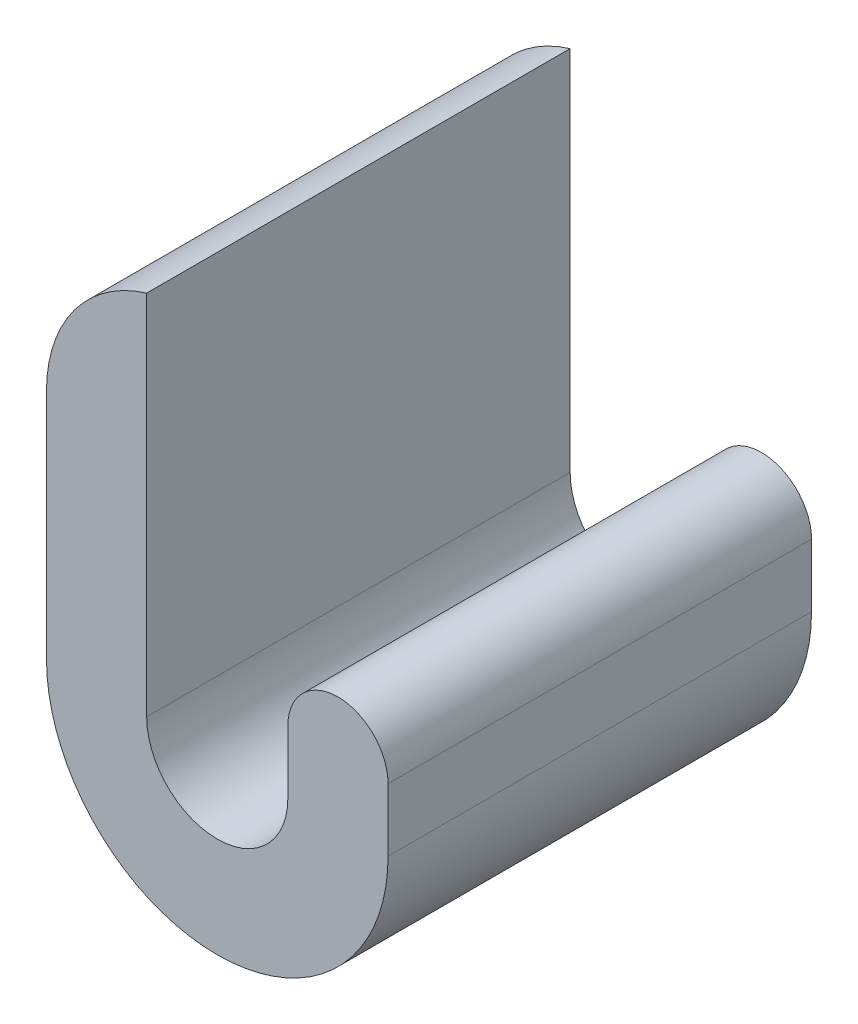
ISO-10303-21;
HEADER;
FILE_DESCRIPTION(('STEP AP214'),'2;1');
FILE_NAME('part.step','',(''),(''),'','','');
FILE_SCHEMA(('AUTOMOTIVE_DESIGN { 1 0 10303 214 1 1 1 1 }'));
ENDSEC;
DATA;
#1=APPLICATION_CONTEXT('core data for automotive mechanical design processes');
#2=APPLICATION_PROTOCOL_DEFINITION('international standard','automotive_design',2000,#1);
#3=PRODUCT_CONTEXT('',#1,'mechanical');
#4=PRODUCT('Part','Part','',(#3));
#5=PRODUCT_RELATED_PRODUCT_CATEGORY('part','',(#4));
#6=PRODUCT_DEFINITION_FORMATION('','',#4);
#7=PRODUCT_DEFINITION_CONTEXT('part definition',#1,'design');
#8=PRODUCT_DEFINITION('design','',#6,#7);
#9=PRODUCT_DEFINITION_SHAPE('','',#8);
#10=(LENGTH_UNIT() NAMED_UNIT(*) SI_UNIT(.MILLI.,.METRE.));
#11=(NAMED_UNIT(*) PLANE_ANGLE_UNIT() SI_UNIT($,.RADIAN.));
#12=(NAMED_UNIT(*) SI_UNIT($,.STERADIAN.) SOLID_ANGLE_UNIT());
#13=UNCERTAINTY_MEASURE_WITH_UNIT(LENGTH_MEASURE(1.E-05),#10,'distance_accuracy_value','');
#14=(GEOMETRIC_REPRESENTATION_CONTEXT(3) GLOBAL_UNCERTAINTY_ASSIGNED_CONTEXT((#13)) GLOBAL_UNIT_ASSIGNED_CONTEXT((#10,
#11,#12)) REPRESENTATION_CONTEXT('',''));
#15=CARTESIAN_POINT('',(0.,0.,0.));
#16=DIRECTION('',(0.,0.,1.));
#17=DIRECTION('',(1.,0.,0.));
#18=AXIS2_PLACEMENT_3D('',#15,#16,#17);
#19=CARTESIAN_POINT('',(8.55,4.45,0.));
#20=DIRECTION('',(0.,0.,1.));
#21=DIRECTION('',(1.,0.,0.));
#22=AXIS2_PLACEMENT_3D('',#19,#20,#21);
#23=CYLINDRICAL_SURFACE('',#22,3.55);
#24=DIRECTION('',(0.,0.,1.));
#25=VECTOR('',#24,1.);
#26=CARTESIAN_POINT('',(5.,4.45,-30.));
#27=LINE('',#26,#25);
#28=CARTESIAN_POINT('',(5.,4.45,0.));
#29=VERTEX_POINT('',#28);
#30=CARTESIAN_POINT('',(5.,4.45,-30.));
#31=VERTEX_POINT('',#30);
#32=EDGE_CURVE('E157',#29,#31,#27,.F.);
#33=ORIENTED_EDGE('',*,*,#32,.F.);
#34=CARTESIAN_POINT('',(8.55,4.45,0.));
#35=DIRECTION('',(0.,0.,1.));
#36=DIRECTION('',(1.,0.,0.));
#37=AXIS2_PLACEMENT_3D('',#34,#35,#36);
#38=CIRCLE('',#37,3.55);
#39=CARTESIAN_POINT('',(12.1,4.45,0.));
#40=VERTEX_POINT('',#39);
#41=EDGE_CURVE('E40',#40,#29,#38,.T.);
#42=ORIENTED_EDGE('',*,*,#41,.F.);
#43=DIRECTION('',(0.,0.,1.));
#44=VECTOR('',#43,1.);
#45=CARTESIAN_POINT('',(12.1,4.45,-30.));
#46=LINE('',#45,#44);
#47=CARTESIAN_POINT('',(12.1,4.45,-30.));
#48=VERTEX_POINT('',#47);
#49=EDGE_CURVE('E160',#48,#40,#46,.T.);
#50=ORIENTED_EDGE('',*,*,#49,.F.);
#51=CARTESIAN_POINT('',(8.55,4.45,-30.));
#52=DIRECTION('',(0.,0.,1.));
#53=DIRECTION('',(1.,0.,0.));
#54=AXIS2_PLACEMENT_3D('',#51,#52,#53);
#55=CIRCLE('',#54,3.55);
#56=EDGE_CURVE('E11',#31,#48,#55,.F.);
#57=ORIENTED_EDGE('',*,*,#56,.F.);
#58=EDGE_LOOP('',(#33,#42,#50,#57));
#59=FACE_BOUND('',#58,.T.);
#60=ADVANCED_FACE('F33',(#59),#23,.T.);
#61=CARTESIAN_POINT('',(0.,0.,-30.));
#62=DIRECTION('',(0.,0.,1.));
#63=DIRECTION('',(1.,0.,0.));
#64=AXIS2_PLACEMENT_3D('',#61,#62,#63);
#65=CYLINDRICAL_SURFACE('',#64,5.);
#66=CARTESIAN_POINT('',(0.,0.,0.));
#67=DIRECTION('',(0.,0.,-1.));
#68=DIRECTION('',(1.,0.,0.));
#69=AXIS2_PLACEMENT_3D('',#66,#67,#68);
#70=CIRCLE('',#69,5.);
#71=CARTESIAN_POINT('',(5.,0.,0.));
#72=VERTEX_POINT('',#71);
#73=CARTESIAN_POINT('',(-5.,0.,0.));
#74=VERTEX_POINT('',#73);
#75=EDGE_CURVE('E135',#72,#74,#70,.T.);
#76=ORIENTED_EDGE('',*,*,#75,.F.);
#77=DIRECTION('',(0.,0.,1.));
#78=VECTOR('',#77,1.);
#79=CARTESIAN_POINT('',(5.,0.,-30.));
#80=LINE('',#79,#78);
#81=CARTESIAN_POINT('',(5.,0.,-30.));
#82=VERTEX_POINT('',#81);
#83=EDGE_CURVE('E121',#82,#72,#80,.T.);
#84=ORIENTED_EDGE('',*,*,#83,.F.);
#85=CARTESIAN_POINT('',(0.,0.,-30.));
#86=DIRECTION('',(0.,0.,-1.));
#87=DIRECTION('',(1.,0.,0.));
#88=AXIS2_PLACEMENT_3D('',#85,#86,#87);
#89=CIRCLE('',#88,5.);
#90=CARTESIAN_POINT('',(-5.,0.,-30.));
#91=VERTEX_POINT('',#90);
#92=EDGE_CURVE('E112',#82,#91,#89,.T.);
#93=ORIENTED_EDGE('',*,*,#92,.T.);
#94=DIRECTION('',(0.,0.,1.));
#95=VECTOR('',#94,1.);
#96=CARTESIAN_POINT('',(-5.,0.,-30.));
#97=LINE('',#96,#95);
#98=EDGE_CURVE('E95',#91,#74,#97,.T.);
#99=ORIENTED_EDGE('',*,*,#98,.T.);
#100=EDGE_LOOP('',(#76,#84,#93,#99));
#101=FACE_BOUND('',#100,.T.);
#102=ADVANCED_FACE('F119',(#101),#65,.F.);
#103=CARTESIAN_POINT('',(5.,0.,-30.));
#104=DIRECTION('',(-1.,0.,0.));
#105=DIRECTION('',(0.,0.,1.));
#106=AXIS2_PLACEMENT_3D('',#103,#104,#105);
#107=PLANE('',#106);
#108=DIRECTION('',(0.,-1.,0.));
#109=VECTOR('',#108,1.);
#110=CARTESIAN_POINT('',(5.,0.,0.));
#111=LINE('',#110,#109);
#112=EDGE_CURVE('E122',#29,#72,#111,.T.);
#113=ORIENTED_EDGE('',*,*,#112,.F.);
#114=ORIENTED_EDGE('',*,*,#32,.T.);
#115=DIRECTION('',(0.,-1.,0.));
#116=VECTOR('',#115,1.);
#117=CARTESIAN_POINT('',(5.,0.,-30.));
#118=LINE('',#117,#116);
#119=EDGE_CURVE('E108',#31,#82,#118,.T.);
#120=ORIENTED_EDGE('',*,*,#119,.T.);
#121=ORIENTED_EDGE('',*,*,#83,.T.);
#122=EDGE_LOOP('',(#113,#114,#120,#121));
#123=FACE_BOUND('',#122,.T.);
#124=ADVANCED_FACE('F166',(#123),#107,.T.);
#125=CARTESIAN_POINT('',(12.1,8.,-30.));
#126=DIRECTION('',(1.,0.,0.));
#127=DIRECTION('',(0.,0.,-1.));
#128=AXIS2_PLACEMENT_3D('',#125,#126,#127);
#129=PLANE('',#128);
#130=DIRECTION('',(0.,1.,0.));
#131=VECTOR('',#130,1.);
#132=CARTESIAN_POINT('',(12.1,8.,-30.));
#133=LINE('',#132,#131);
#134=CARTESIAN_POINT('',(12.1,0.,-30.));
#135=VERTEX_POINT('',#134);
#136=EDGE_CURVE('E131',#135,#48,#133,.T.);
#137=ORIENTED_EDGE('',*,*,#136,.T.);
#138=ORIENTED_EDGE('',*,*,#49,.T.);
#139=DIRECTION('',(0.,1.,0.));
#140=VECTOR('',#139,1.);
#141=CARTESIAN_POINT('',(12.1,8.,0.));
#142=LINE('',#141,#140);
#143=CARTESIAN_POINT('',(12.1,0.,0.));
#144=VERTEX_POINT('',#143);
#145=EDGE_CURVE('E124',#144,#40,#142,.T.);
#146=ORIENTED_EDGE('',*,*,#145,.F.);
#147=DIRECTION('',(0.,0.,1.));
#148=VECTOR('',#147,1.);
#149=CARTESIAN_POINT('',(12.1,0.,-30.));
#150=LINE('',#149,#148);
#151=EDGE_CURVE('E147',#135,#144,#150,.T.);
#152=ORIENTED_EDGE('',*,*,#151,.F.);
#153=EDGE_LOOP('',(#137,#138,#146,#152));
#154=FACE_BOUND('',#153,.T.);
#155=ADVANCED_FACE('F188',(#154),#129,.T.);
#156=CARTESIAN_POINT('',(0.,0.,-30.));
#157=DIRECTION('',(0.,0.,1.));
#158=DIRECTION('',(1.,0.,0.));
#159=AXIS2_PLACEMENT_3D('',#156,#157,#158);
#160=CYLINDRICAL_SURFACE('',#159,12.1);
#161=CARTESIAN_POINT('',(0.,0.,0.));
#162=DIRECTION('',(0.,0.,1.));
#163=DIRECTION('',(1.,0.,0.));
#164=AXIS2_PLACEMENT_3D('',#161,#162,#163);
#165=CIRCLE('',#164,12.1);
#166=CARTESIAN_POINT('',(-12.1,0.,0.));
#167=VERTEX_POINT('',#166);
#168=EDGE_CURVE('E140',#167,#144,#165,.T.);
#169=ORIENTED_EDGE('',*,*,#168,.F.);
#170=DIRECTION('',(0.,0.,1.));
#171=VECTOR('',#170,1.);
#172=CARTESIAN_POINT('',(-12.1,0.,-30.));
#173=LINE('',#172,#171);
#174=CARTESIAN_POINT('',(-12.1,0.,-30.));
#175=VERTEX_POINT('',#174);
#176=EDGE_CURVE('E149',#175,#167,#173,.T.);
#177=ORIENTED_EDGE('',*,*,#176,.F.);
#178=CARTESIAN_POINT('',(0.,0.,-30.));
#179=DIRECTION('',(0.,0.,1.));
#180=DIRECTION('',(1.,0.,0.));
#181=AXIS2_PLACEMENT_3D('',#178,#179,#180);
#182=CIRCLE('',#181,12.1);
#183=EDGE_CURVE('E128',#175,#135,#182,.T.);
#184=ORIENTED_EDGE('',*,*,#183,.T.);
#185=ORIENTED_EDGE('',*,*,#151,.T.);
#186=EDGE_LOOP('',(#169,#177,#184,#185));
#187=FACE_BOUND('',#186,.T.);
#188=ADVANCED_FACE('F195',(#187),#160,.T.);
#189=CARTESIAN_POINT('',(-12.1,26.,-30.));
#190=DIRECTION('',(-1.,0.,0.));
#191=DIRECTION('',(0.,-1.,0.));
#192=AXIS2_PLACEMENT_3D('',#189,#190,#191);
#193=PLANE('',#192);
#194=DIRECTION('',(0.,-1.,0.));
#195=VECTOR('',#194,1.);
#196=CARTESIAN_POINT('',(-12.1,26.,0.));
#197=LINE('',#196,#195);
#198=CARTESIAN_POINT('',(-12.1,16.4297335460291,0.));
#199=VERTEX_POINT('',#198);
#200=EDGE_CURVE('E138',#199,#167,#197,.T.);
#201=ORIENTED_EDGE('',*,*,#200,.F.);
#202=DIRECTION('',(0.,0.,1.));
#203=VECTOR('',#202,1.);
#204=CARTESIAN_POINT('',(-12.1,16.4297335460291,-30.));
#205=LINE('',#204,#203);
#206=CARTESIAN_POINT('',(-12.1,16.4297335460291,-30.));
#207=VERTEX_POINT('',#206);
#208=EDGE_CURVE('E154',#199,#207,#205,.F.);
#209=ORIENTED_EDGE('',*,*,#208,.T.);
#210=DIRECTION('',(0.,-1.,0.));
#211=VECTOR('',#210,1.);
#212=CARTESIAN_POINT('',(-12.1,26.,-30.));
#213=LINE('',#212,#211);
#214=EDGE_CURVE('E116',#207,#175,#213,.T.);
#215=ORIENTED_EDGE('',*,*,#214,.T.);
#216=ORIENTED_EDGE('',*,*,#176,.T.);
#217=EDGE_LOOP('',(#201,#209,#215,#216));
#218=FACE_BOUND('',#217,.T.);
#219=ADVANCED_FACE('F171',(#218),#193,.T.);
#220=CARTESIAN_POINT('',(-5.,0.,-30.));
#221=DIRECTION('',(1.,0.,0.));
#222=DIRECTION('',(0.,0.,-1.));
#223=AXIS2_PLACEMENT_3D('',#220,#221,#222);
#224=PLANE('',#223);
#225=DIRECTION('',(0.,1.,0.));
#226=VECTOR('',#225,1.);
#227=CARTESIAN_POINT('',(-5.,0.,0.));
#228=LINE('',#227,#226);
#229=CARTESIAN_POINT('',(-5.,26.,0.));
#230=VERTEX_POINT('',#229);
#231=EDGE_CURVE('E102',#74,#230,#228,.T.);
#232=ORIENTED_EDGE('',*,*,#231,.F.);
#233=ORIENTED_EDGE('',*,*,#98,.F.);
#234=DIRECTION('',(0.,1.,0.));
#235=VECTOR('',#234,1.);
#236=CARTESIAN_POINT('',(-5.,0.,-30.));
#237=LINE('',#236,#235);
#238=CARTESIAN_POINT('',(-5.,26.,-30.));
#239=VERTEX_POINT('',#238);
#240=EDGE_CURVE('E99',#91,#239,#237,.T.);
#241=ORIENTED_EDGE('',*,*,#240,.T.);
#242=DIRECTION('',(0.,0.,1.));
#243=VECTOR('',#242,1.);
#244=CARTESIAN_POINT('',(-5.,26.,-30.));
#245=LINE('',#244,#243);
#246=EDGE_CURVE('E107',#239,#230,#245,.T.);
#247=ORIENTED_EDGE('',*,*,#246,.T.);
#248=EDGE_LOOP('',(#232,#233,#241,#247));
#249=FACE_BOUND('',#248,.T.);
#250=ADVANCED_FACE('F97',(#249),#224,.T.);
#251=CARTESIAN_POINT('',(0.,0.,-30.));
#252=DIRECTION('',(0.,0.,1.));
#253=DIRECTION('',(1.,0.,0.));
#254=AXIS2_PLACEMENT_3D('',#251,#252,#253);
#255=PLANE('',#254);
#256=ORIENTED_EDGE('',*,*,#119,.F.);
#257=ORIENTED_EDGE('',*,*,#56,.T.);
#258=ORIENTED_EDGE('',*,*,#136,.F.);
#259=ORIENTED_EDGE('',*,*,#183,.F.);
#260=ORIENTED_EDGE('',*,*,#214,.F.);
#261=CARTESIAN_POINT('',(-2.1,16.4297335460291,-30.));
#262=DIRECTION('',(0.,0.,1.));
#263=DIRECTION('',(1.,0.,0.));
#264=AXIS2_PLACEMENT_3D('',#261,#262,#263);
#265=CIRCLE('',#264,10.);
#266=EDGE_CURVE('E115',#207,#239,#265,.F.);
#267=ORIENTED_EDGE('',*,*,#266,.T.);
#268=ORIENTED_EDGE('',*,*,#240,.F.);
#269=ORIENTED_EDGE('',*,*,#92,.F.);
#270=EDGE_LOOP('',(#256,#257,#258,#259,#260,#267,#268,#269));
#271=FACE_BOUND('',#270,.T.);
#272=ADVANCED_FACE('F111',(#271),#255,.F.);
#273=CARTESIAN_POINT('',(0.,0.,0.));
#274=DIRECTION('',(0.,0.,1.));
#275=DIRECTION('',(1.,0.,0.));
#276=AXIS2_PLACEMENT_3D('',#273,#274,#275);
#277=PLANE('',#276);
#278=ORIENTED_EDGE('',*,*,#145,.T.);
#279=ORIENTED_EDGE('',*,*,#41,.T.);
#280=ORIENTED_EDGE('',*,*,#112,.T.);
#281=ORIENTED_EDGE('',*,*,#75,.T.);
#282=ORIENTED_EDGE('',*,*,#231,.T.);
#283=CARTESIAN_POINT('',(-2.1,16.4297335460291,0.));
#284=DIRECTION('',(0.,0.,1.));
#285=DIRECTION('',(1.,0.,0.));
#286=AXIS2_PLACEMENT_3D('',#283,#284,#285);
#287=CIRCLE('',#286,10.);
#288=EDGE_CURVE('E146',#230,#199,#287,.T.);
#289=ORIENTED_EDGE('',*,*,#288,.T.);
#290=ORIENTED_EDGE('',*,*,#200,.T.);
#291=ORIENTED_EDGE('',*,*,#168,.T.);
#292=EDGE_LOOP('',(#278,#279,#280,#281,#282,#289,#290,#291));
#293=FACE_BOUND('',#292,.T.);
#294=ADVANCED_FACE('F162',(#293),#277,.T.);
#295=CARTESIAN_POINT('',(-2.1,16.4297335460291,-30.));
#296=DIRECTION('',(0.,0.,-1.));
#297=DIRECTION('',(-1.,0.,0.));
#298=AXIS2_PLACEMENT_3D('',#295,#296,#297);
#299=CYLINDRICAL_SURFACE('',#298,10.);
#300=ORIENTED_EDGE('',*,*,#266,.F.);
#301=ORIENTED_EDGE('',*,*,#208,.F.);
#302=ORIENTED_EDGE('',*,*,#288,.F.);
#303=ORIENTED_EDGE('',*,*,#246,.F.);
#304=EDGE_LOOP('',(#300,#301,#302,#303));
#305=FACE_BOUND('',#304,.T.);
#306=ADVANCED_FACE('F174',(#305),#299,.T.);
#307=CLOSED_SHELL('',(#60,#102,#124,#155,#188,#219,#250,#272,#294,#306));
#308=MANIFOLD_SOLID_BREP('B2',#307);
#309=ADVANCED_BREP_SHAPE_REPRESENTATION('',(#18,#308),#14);
#310=SHAPE_DEFINITION_REPRESENTATION(#9,#309);
ENDSEC;
END-ISO-10303-21;
